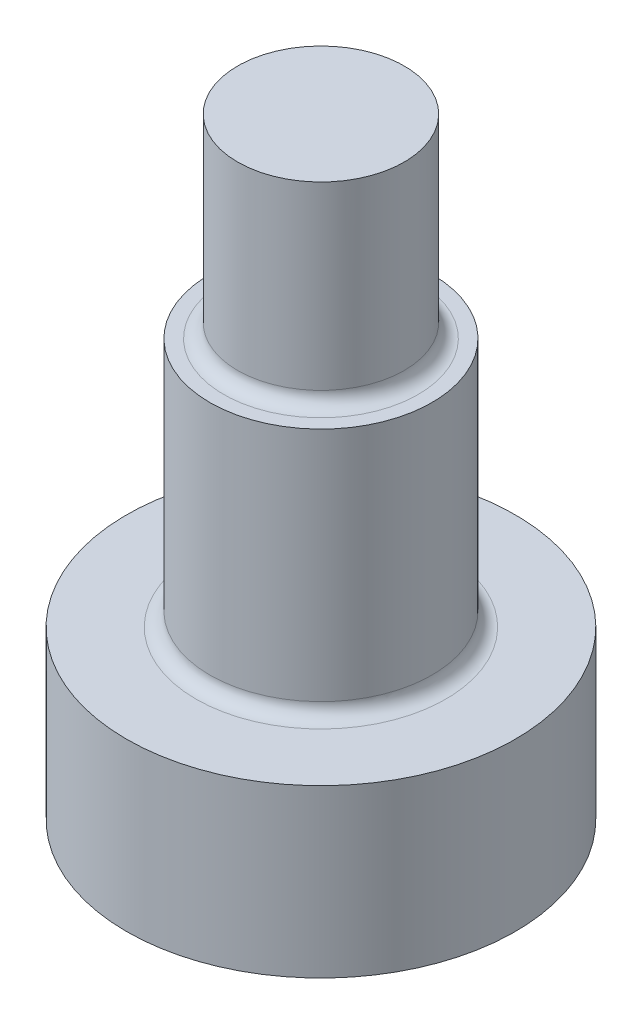
ISO-10303-21;
HEADER;
FILE_DESCRIPTION(('STEP AP214'),'2;1');
FILE_NAME('part.step','',(''),(''),'','','');
FILE_SCHEMA(('AUTOMOTIVE_DESIGN { 1 0 10303 214 1 1 1 1 }'));
ENDSEC;
DATA;
#1=APPLICATION_CONTEXT('core data for automotive mechanical design processes');
#2=APPLICATION_PROTOCOL_DEFINITION('international standard','automotive_design',2000,#1);
#3=PRODUCT_CONTEXT('',#1,'mechanical');
#4=PRODUCT('Part','Part','',(#3));
#5=PRODUCT_RELATED_PRODUCT_CATEGORY('part','',(#4));
#6=PRODUCT_DEFINITION_FORMATION('','',#4);
#7=PRODUCT_DEFINITION_CONTEXT('part definition',#1,'design');
#8=PRODUCT_DEFINITION('design','',#6,#7);
#9=PRODUCT_DEFINITION_SHAPE('','',#8);
#10=(LENGTH_UNIT() NAMED_UNIT(*) SI_UNIT(.MILLI.,.METRE.));
#11=(NAMED_UNIT(*) PLANE_ANGLE_UNIT() SI_UNIT($,.RADIAN.));
#12=(NAMED_UNIT(*) SI_UNIT($,.STERADIAN.) SOLID_ANGLE_UNIT());
#13=UNCERTAINTY_MEASURE_WITH_UNIT(LENGTH_MEASURE(1.E-05),#10,'distance_accuracy_value','');
#14=(GEOMETRIC_REPRESENTATION_CONTEXT(3) GLOBAL_UNCERTAINTY_ASSIGNED_CONTEXT((#13)) GLOBAL_UNIT_ASSIGNED_CONTEXT((#10,
#11,#12)) REPRESENTATION_CONTEXT('',''));
#15=CARTESIAN_POINT('',(0.,0.,0.));
#16=DIRECTION('',(0.,0.,1.));
#17=DIRECTION('',(1.,0.,0.));
#18=AXIS2_PLACEMENT_3D('',#15,#16,#17);
#19=CARTESIAN_POINT('',(0.,0.,0.));
#20=DIRECTION('',(0.,1.,0.));
#21=DIRECTION('',(0.,0.,1.));
#22=AXIS2_PLACEMENT_3D('',#19,#20,#21);
#23=PLANE('',#22);
#24=DIRECTION('',(0.866025403784439,0.,0.5));
#25=VECTOR('',#24,1.);
#26=CARTESIAN_POINT('',(0.,0.,-4.61880215351701));
#27=LINE('',#26,#25);
#28=CARTESIAN_POINT('',(0.,0.,-4.61880215351701));
#29=VERTEX_POINT('',#28);
#30=CARTESIAN_POINT('',(4.,0.,-2.3094010767585));
#31=VERTEX_POINT('',#30);
#32=EDGE_CURVE('E121',#29,#31,#27,.T.);
#33=ORIENTED_EDGE('',*,*,#32,.F.);
#34=DIRECTION('',(0.866025403784439,0.,-0.5));
#35=VECTOR('',#34,1.);
#36=CARTESIAN_POINT('',(-4.,0.,-2.3094010767585));
#37=LINE('',#36,#35);
#38=CARTESIAN_POINT('',(-4.,0.,-2.3094010767585));
#39=VERTEX_POINT('',#38);
#40=EDGE_CURVE('E47',#39,#29,#37,.T.);
#41=ORIENTED_EDGE('',*,*,#40,.F.);
#42=DIRECTION('',(0.,0.,-1.));
#43=VECTOR('',#42,1.);
#44=CARTESIAN_POINT('',(-4.,0.,2.3094010767585));
#45=LINE('',#44,#43);
#46=CARTESIAN_POINT('',(-4.,0.,2.3094010767585));
#47=VERTEX_POINT('',#46);
#48=EDGE_CURVE('E130',#47,#39,#45,.T.);
#49=ORIENTED_EDGE('',*,*,#48,.F.);
#50=DIRECTION('',(-0.866025403784439,0.,-0.5));
#51=VECTOR('',#50,1.);
#52=CARTESIAN_POINT('',(0.,0.,4.61880215351701));
#53=LINE('',#52,#51);
#54=CARTESIAN_POINT('',(0.,0.,4.61880215351701));
#55=VERTEX_POINT('',#54);
#56=EDGE_CURVE('E128',#55,#47,#53,.T.);
#57=ORIENTED_EDGE('',*,*,#56,.F.);
#58=DIRECTION('',(-0.866025403784439,0.,0.5));
#59=VECTOR('',#58,1.);
#60=CARTESIAN_POINT('',(4.,0.,2.3094010767585));
#61=LINE('',#60,#59);
#62=CARTESIAN_POINT('',(4.,0.,2.3094010767585));
#63=VERTEX_POINT('',#62);
#64=EDGE_CURVE('E95',#63,#55,#61,.T.);
#65=ORIENTED_EDGE('',*,*,#64,.F.);
#66=DIRECTION('',(0.,0.,1.));
#67=VECTOR('',#66,1.);
#68=CARTESIAN_POINT('',(4.,0.,-2.3094010767585));
#69=LINE('',#68,#67);
#70=EDGE_CURVE('E124',#31,#63,#69,.T.);
#71=ORIENTED_EDGE('',*,*,#70,.F.);
#72=EDGE_LOOP('',(#33,#41,#49,#57,#65,#71));
#73=FACE_BOUND('',#72,.T.);
#74=CARTESIAN_POINT('',(0.,0.,0.));
#75=DIRECTION('',(0.,1.,0.));
#76=DIRECTION('',(0.,0.,1.));
#77=AXIS2_PLACEMENT_3D('',#74,#75,#76);
#78=CIRCLE('',#77,7.);
#79=CARTESIAN_POINT('',(0.,0.,7.));
#80=VERTEX_POINT('',#79);
#81=EDGE_CURVE('E148',#80,#80,#78,.T.);
#82=ORIENTED_EDGE('',*,*,#81,.F.);
#83=EDGE_LOOP('',(#82));
#84=FACE_BOUND('',#83,.T.);
#85=ADVANCED_FACE('F32',(#73,#84),#23,.F.);
#86=CARTESIAN_POINT('',(0.,22.,0.));
#87=DIRECTION('',(0.,1.,0.));
#88=DIRECTION('',(0.,0.,1.));
#89=AXIS2_PLACEMENT_3D('',#86,#87,#88);
#90=CYLINDRICAL_SURFACE('',#89,7.);
#91=CARTESIAN_POINT('',(0.,6.,0.));
#92=DIRECTION('',(0.,1.,0.));
#93=DIRECTION('',(0.,0.,1.));
#94=AXIS2_PLACEMENT_3D('',#91,#92,#93);
#95=CIRCLE('',#94,7.);
#96=CARTESIAN_POINT('',(0.,6.,7.));
#97=VERTEX_POINT('',#96);
#98=EDGE_CURVE('E145',#97,#97,#95,.T.);
#99=ORIENTED_EDGE('',*,*,#98,.F.);
#100=EDGE_LOOP('',(#99));
#101=FACE_BOUND('',#100,.T.);
#102=ORIENTED_EDGE('',*,*,#81,.T.);
#103=EDGE_LOOP('',(#102));
#104=FACE_BOUND('',#103,.T.);
#105=ADVANCED_FACE('F171',(#101,#104),#90,.T.);
#106=CARTESIAN_POINT('',(7.,6.,0.));
#107=DIRECTION('',(0.,-1.,0.));
#108=DIRECTION('',(0.,0.,-1.));
#109=AXIS2_PLACEMENT_3D('',#106,#107,#108);
#110=PLANE('',#109);
#111=CARTESIAN_POINT('',(0.,6.,0.));
#112=DIRECTION('',(0.,-1.,0.));
#113=DIRECTION('',(0.,0.,-1.));
#114=AXIS2_PLACEMENT_3D('',#111,#112,#113);
#115=CIRCLE('',#114,4.5);
#116=CARTESIAN_POINT('',(0.,6.,-4.5));
#117=VERTEX_POINT('',#116);
#118=EDGE_CURVE('E154',#117,#117,#115,.T.);
#119=ORIENTED_EDGE('',*,*,#118,.T.);
#120=EDGE_LOOP('',(#119));
#121=FACE_BOUND('',#120,.T.);
#122=ORIENTED_EDGE('',*,*,#98,.T.);
#123=EDGE_LOOP('',(#122));
#124=FACE_BOUND('',#123,.T.);
#125=ADVANCED_FACE('F177',(#121,#124),#110,.F.);
#126=CARTESIAN_POINT('',(0.,22.,0.));
#127=DIRECTION('',(0.,1.,0.));
#128=DIRECTION('',(0.,0.,1.));
#129=AXIS2_PLACEMENT_3D('',#126,#127,#128);
#130=CYLINDRICAL_SURFACE('',#129,4.);
#131=CARTESIAN_POINT('',(0.,6.5,0.));
#132=DIRECTION('',(0.,-1.,0.));
#133=DIRECTION('',(0.,0.,-1.));
#134=AXIS2_PLACEMENT_3D('',#131,#132,#133);
#135=CIRCLE('',#134,4.);
#136=CARTESIAN_POINT('',(0.,6.5,-4.));
#137=VERTEX_POINT('',#136);
#138=EDGE_CURVE('E151',#137,#137,#135,.F.);
#139=ORIENTED_EDGE('',*,*,#138,.T.);
#140=EDGE_LOOP('',(#139));
#141=FACE_BOUND('',#140,.T.);
#142=CARTESIAN_POINT('',(0.,15.,0.));
#143=DIRECTION('',(0.,1.,0.));
#144=DIRECTION('',(0.,0.,1.));
#145=AXIS2_PLACEMENT_3D('',#142,#143,#144);
#146=CIRCLE('',#145,4.);
#147=CARTESIAN_POINT('',(0.,15.,4.));
#148=VERTEX_POINT('',#147);
#149=EDGE_CURVE('E142',#148,#148,#146,.T.);
#150=ORIENTED_EDGE('',*,*,#149,.F.);
#151=EDGE_LOOP('',(#150));
#152=FACE_BOUND('',#151,.T.);
#153=ADVANCED_FACE('F185',(#141,#152),#130,.T.);
#154=CARTESIAN_POINT('',(4.,15.,0.));
#155=DIRECTION('',(0.,-1.,0.));
#156=DIRECTION('',(0.,0.,-1.));
#157=AXIS2_PLACEMENT_3D('',#154,#155,#156);
#158=PLANE('',#157);
#159=CARTESIAN_POINT('',(0.,15.,0.));
#160=DIRECTION('',(0.,-1.,0.));
#161=DIRECTION('',(0.,0.,-1.));
#162=AXIS2_PLACEMENT_3D('',#159,#160,#161);
#163=CIRCLE('',#162,3.5);
#164=CARTESIAN_POINT('',(0.,15.,-3.5));
#165=VERTEX_POINT('',#164);
#166=EDGE_CURVE('E11',#165,#165,#163,.T.);
#167=ORIENTED_EDGE('',*,*,#166,.T.);
#168=EDGE_LOOP('',(#167));
#169=FACE_BOUND('',#168,.T.);
#170=ORIENTED_EDGE('',*,*,#149,.T.);
#171=EDGE_LOOP('',(#170));
#172=FACE_BOUND('',#171,.T.);
#173=ADVANCED_FACE('F189',(#169,#172),#158,.F.);
#174=CARTESIAN_POINT('',(0.,22.,0.));
#175=DIRECTION('',(0.,1.,0.));
#176=DIRECTION('',(0.,0.,1.));
#177=AXIS2_PLACEMENT_3D('',#174,#175,#176);
#178=CYLINDRICAL_SURFACE('',#177,3.);
#179=CARTESIAN_POINT('',(0.,15.5,0.));
#180=DIRECTION('',(0.,-1.,0.));
#181=DIRECTION('',(0.,0.,-1.));
#182=AXIS2_PLACEMENT_3D('',#179,#180,#181);
#183=CIRCLE('',#182,3.);
#184=CARTESIAN_POINT('',(0.,15.5,-3.));
#185=VERTEX_POINT('',#184);
#186=EDGE_CURVE('E40',#185,#185,#183,.F.);
#187=ORIENTED_EDGE('',*,*,#186,.T.);
#188=EDGE_LOOP('',(#187));
#189=FACE_BOUND('',#188,.T.);
#190=CARTESIAN_POINT('',(0.,22.,0.));
#191=DIRECTION('',(0.,1.,0.));
#192=DIRECTION('',(0.,0.,1.));
#193=AXIS2_PLACEMENT_3D('',#190,#191,#192);
#194=CIRCLE('',#193,3.);
#195=CARTESIAN_POINT('',(0.,22.,3.));
#196=VERTEX_POINT('',#195);
#197=EDGE_CURVE('E134',#196,#196,#194,.T.);
#198=ORIENTED_EDGE('',*,*,#197,.F.);
#199=EDGE_LOOP('',(#198));
#200=FACE_BOUND('',#199,.T.);
#201=ADVANCED_FACE('F159',(#189,#200),#178,.T.);
#202=CARTESIAN_POINT('',(3.,22.,0.));
#203=DIRECTION('',(0.,-1.,0.));
#204=DIRECTION('',(0.,0.,-1.));
#205=AXIS2_PLACEMENT_3D('',#202,#203,#204);
#206=PLANE('',#205);
#207=ORIENTED_EDGE('',*,*,#197,.T.);
#208=EDGE_LOOP('',(#207));
#209=FACE_BOUND('',#208,.T.);
#210=ADVANCED_FACE('F196',(#209),#206,.F.);
#211=CARTESIAN_POINT('',(-4.,2.,-2.3094010767585));
#212=DIRECTION('',(-0.5,0.,-0.866025403784439));
#213=DIRECTION('',(-0.866025403784439,0.,0.5));
#214=AXIS2_PLACEMENT_3D('',#211,#212,#213);
#215=PLANE('',#214);
#216=ORIENTED_EDGE('',*,*,#40,.T.);
#217=DIRECTION('',(0.,-1.,0.));
#218=VECTOR('',#217,1.);
#219=CARTESIAN_POINT('',(0.,2.,-4.61880215351701));
#220=LINE('',#219,#218);
#221=CARTESIAN_POINT('',(0.,2.,-4.61880215351701));
#222=VERTEX_POINT('',#221);
#223=EDGE_CURVE('E77',#222,#29,#220,.T.);
#224=ORIENTED_EDGE('',*,*,#223,.F.);
#225=DIRECTION('',(0.866025403784439,0.,-0.5));
#226=VECTOR('',#225,1.);
#227=CARTESIAN_POINT('',(-4.,2.,-2.3094010767585));
#228=LINE('',#227,#226);
#229=CARTESIAN_POINT('',(-4.,2.,-2.3094010767585));
#230=VERTEX_POINT('',#229);
#231=EDGE_CURVE('E132',#230,#222,#228,.T.);
#232=ORIENTED_EDGE('',*,*,#231,.F.);
#233=DIRECTION('',(0.,-1.,0.));
#234=VECTOR('',#233,1.);
#235=CARTESIAN_POINT('',(-4.,2.,-2.3094010767585));
#236=LINE('',#235,#234);
#237=EDGE_CURVE('E55',#230,#39,#236,.T.);
#238=ORIENTED_EDGE('',*,*,#237,.T.);
#239=EDGE_LOOP('',(#216,#224,#232,#238));
#240=FACE_BOUND('',#239,.T.);
#241=ADVANCED_FACE('F199',(#240),#215,.F.);
#242=CARTESIAN_POINT('',(-4.,2.,2.3094010767585));
#243=DIRECTION('',(-1.,0.,0.));
#244=DIRECTION('',(0.,0.,1.));
#245=AXIS2_PLACEMENT_3D('',#242,#243,#244);
#246=PLANE('',#245);
#247=ORIENTED_EDGE('',*,*,#48,.T.);
#248=ORIENTED_EDGE('',*,*,#237,.F.);
#249=DIRECTION('',(0.,0.,-1.));
#250=VECTOR('',#249,1.);
#251=CARTESIAN_POINT('',(-4.,2.,2.3094010767585));
#252=LINE('',#251,#250);
#253=CARTESIAN_POINT('',(-4.,2.,2.3094010767585));
#254=VERTEX_POINT('',#253);
#255=EDGE_CURVE('E107',#254,#230,#252,.T.);
#256=ORIENTED_EDGE('',*,*,#255,.F.);
#257=DIRECTION('',(0.,-1.,0.));
#258=VECTOR('',#257,1.);
#259=CARTESIAN_POINT('',(-4.,2.,2.3094010767585));
#260=LINE('',#259,#258);
#261=EDGE_CURVE('E99',#254,#47,#260,.T.);
#262=ORIENTED_EDGE('',*,*,#261,.T.);
#263=EDGE_LOOP('',(#247,#248,#256,#262));
#264=FACE_BOUND('',#263,.T.);
#265=ADVANCED_FACE('F203',(#264),#246,.F.);
#266=CARTESIAN_POINT('',(0.,2.,4.61880215351701));
#267=DIRECTION('',(-0.5,0.,0.866025403784439));
#268=DIRECTION('',(0.866025403784439,0.,0.5));
#269=AXIS2_PLACEMENT_3D('',#266,#267,#268);
#270=PLANE('',#269);
#271=ORIENTED_EDGE('',*,*,#56,.T.);
#272=ORIENTED_EDGE('',*,*,#261,.F.);
#273=DIRECTION('',(-0.866025403784439,0.,-0.5));
#274=VECTOR('',#273,1.);
#275=CARTESIAN_POINT('',(0.,2.,4.61880215351701));
#276=LINE('',#275,#274);
#277=CARTESIAN_POINT('',(0.,2.,4.61880215351701));
#278=VERTEX_POINT('',#277);
#279=EDGE_CURVE('E103',#278,#254,#276,.T.);
#280=ORIENTED_EDGE('',*,*,#279,.F.);
#281=DIRECTION('',(0.,-1.,0.));
#282=VECTOR('',#281,1.);
#283=CARTESIAN_POINT('',(0.,2.,4.61880215351701));
#284=LINE('',#283,#282);
#285=EDGE_CURVE('E88',#278,#55,#284,.T.);
#286=ORIENTED_EDGE('',*,*,#285,.T.);
#287=EDGE_LOOP('',(#271,#272,#280,#286));
#288=FACE_BOUND('',#287,.T.);
#289=ADVANCED_FACE('F104',(#288),#270,.F.);
#290=CARTESIAN_POINT('',(4.,2.,2.3094010767585));
#291=DIRECTION('',(0.5,0.,0.866025403784439));
#292=DIRECTION('',(0.866025403784439,0.,-0.5));
#293=AXIS2_PLACEMENT_3D('',#290,#291,#292);
#294=PLANE('',#293);
#295=ORIENTED_EDGE('',*,*,#64,.T.);
#296=ORIENTED_EDGE('',*,*,#285,.F.);
#297=DIRECTION('',(-0.866025403784439,0.,0.5));
#298=VECTOR('',#297,1.);
#299=CARTESIAN_POINT('',(4.,2.,2.3094010767585));
#300=LINE('',#299,#298);
#301=CARTESIAN_POINT('',(4.,2.,2.3094010767585));
#302=VERTEX_POINT('',#301);
#303=EDGE_CURVE('E92',#302,#278,#300,.T.);
#304=ORIENTED_EDGE('',*,*,#303,.F.);
#305=DIRECTION('',(0.,-1.,0.));
#306=VECTOR('',#305,1.);
#307=CARTESIAN_POINT('',(4.,2.,2.3094010767585));
#308=LINE('',#307,#306);
#309=EDGE_CURVE('E100',#302,#63,#308,.T.);
#310=ORIENTED_EDGE('',*,*,#309,.T.);
#311=EDGE_LOOP('',(#295,#296,#304,#310));
#312=FACE_BOUND('',#311,.T.);
#313=ADVANCED_FACE('F90',(#312),#294,.F.);
#314=CARTESIAN_POINT('',(4.,2.,-2.3094010767585));
#315=DIRECTION('',(1.,0.,0.));
#316=DIRECTION('',(0.,0.,-1.));
#317=AXIS2_PLACEMENT_3D('',#314,#315,#316);
#318=PLANE('',#317);
#319=ORIENTED_EDGE('',*,*,#70,.T.);
#320=ORIENTED_EDGE('',*,*,#309,.F.);
#321=DIRECTION('',(0.,0.,1.));
#322=VECTOR('',#321,1.);
#323=CARTESIAN_POINT('',(4.,2.,-2.3094010767585));
#324=LINE('',#323,#322);
#325=CARTESIAN_POINT('',(4.,2.,-2.3094010767585));
#326=VERTEX_POINT('',#325);
#327=EDGE_CURVE('E113',#326,#302,#324,.T.);
#328=ORIENTED_EDGE('',*,*,#327,.F.);
#329=DIRECTION('',(0.,-1.,0.));
#330=VECTOR('',#329,1.);
#331=CARTESIAN_POINT('',(4.,2.,-2.3094010767585));
#332=LINE('',#331,#330);
#333=EDGE_CURVE('E137',#326,#31,#332,.T.);
#334=ORIENTED_EDGE('',*,*,#333,.T.);
#335=EDGE_LOOP('',(#319,#320,#328,#334));
#336=FACE_BOUND('',#335,.T.);
#337=ADVANCED_FACE('F207',(#336),#318,.F.);
#338=CARTESIAN_POINT('',(0.,2.,-4.61880215351701));
#339=DIRECTION('',(0.5,0.,-0.866025403784439));
#340=DIRECTION('',(-0.866025403784439,0.,-0.5));
#341=AXIS2_PLACEMENT_3D('',#338,#339,#340);
#342=PLANE('',#341);
#343=ORIENTED_EDGE('',*,*,#32,.T.);
#344=ORIENTED_EDGE('',*,*,#333,.F.);
#345=DIRECTION('',(0.866025403784439,0.,0.5));
#346=VECTOR('',#345,1.);
#347=CARTESIAN_POINT('',(0.,2.,-4.61880215351701));
#348=LINE('',#347,#346);
#349=EDGE_CURVE('E115',#222,#326,#348,.T.);
#350=ORIENTED_EDGE('',*,*,#349,.F.);
#351=ORIENTED_EDGE('',*,*,#223,.T.);
#352=EDGE_LOOP('',(#343,#344,#350,#351));
#353=FACE_BOUND('',#352,.T.);
#354=ADVANCED_FACE('F204',(#353),#342,.F.);
#355=CARTESIAN_POINT('',(0.,2.,0.));
#356=DIRECTION('',(0.,-1.,0.));
#357=DIRECTION('',(0.,0.,-1.));
#358=AXIS2_PLACEMENT_3D('',#355,#356,#357);
#359=PLANE('',#358);
#360=ORIENTED_EDGE('',*,*,#231,.T.);
#361=ORIENTED_EDGE('',*,*,#349,.T.);
#362=ORIENTED_EDGE('',*,*,#327,.T.);
#363=ORIENTED_EDGE('',*,*,#303,.T.);
#364=ORIENTED_EDGE('',*,*,#279,.T.);
#365=ORIENTED_EDGE('',*,*,#255,.T.);
#366=EDGE_LOOP('',(#360,#361,#362,#363,#364,#365));
#367=FACE_BOUND('',#366,.T.);
#368=ADVANCED_FACE('F110',(#367),#359,.T.);
#369=CARTESIAN_POINT('',(0.,6.5,0.));
#370=DIRECTION('',(0.,-1.,0.));
#371=DIRECTION('',(0.,0.,-1.));
#372=AXIS2_PLACEMENT_3D('',#369,#370,#371);
#373=TOROIDAL_SURFACE('',#372,4.5,0.5);
#374=ORIENTED_EDGE('',*,*,#118,.F.);
#375=EDGE_LOOP('',(#374));
#376=FACE_BOUND('',#375,.T.);
#377=ORIENTED_EDGE('',*,*,#138,.F.);
#378=EDGE_LOOP('',(#377));
#379=FACE_BOUND('',#378,.T.);
#380=ADVANCED_FACE('F163',(#376,#379),#373,.F.);
#381=CARTESIAN_POINT('',(0.,15.5,0.));
#382=DIRECTION('',(0.,-1.,0.));
#383=DIRECTION('',(0.,0.,-1.));
#384=AXIS2_PLACEMENT_3D('',#381,#382,#383);
#385=TOROIDAL_SURFACE('',#384,3.5,0.5);
#386=ORIENTED_EDGE('',*,*,#166,.F.);
#387=EDGE_LOOP('',(#386));
#388=FACE_BOUND('',#387,.T.);
#389=ORIENTED_EDGE('',*,*,#186,.F.);
#390=EDGE_LOOP('',(#389));
#391=FACE_BOUND('',#390,.T.);
#392=ADVANCED_FACE('F34',(#388,#391),#385,.F.);
#393=CLOSED_SHELL('',(#85,#105,#125,#153,#173,#201,#210,#241,#265,#289,#313,#337,#354,#368,#380,#392));
#394=MANIFOLD_SOLID_BREP('B2',#393);
#395=ADVANCED_BREP_SHAPE_REPRESENTATION('',(#18,#394),#14);
#396=SHAPE_DEFINITION_REPRESENTATION(#9,#395);
ENDSEC;
END-ISO-10303-21;
